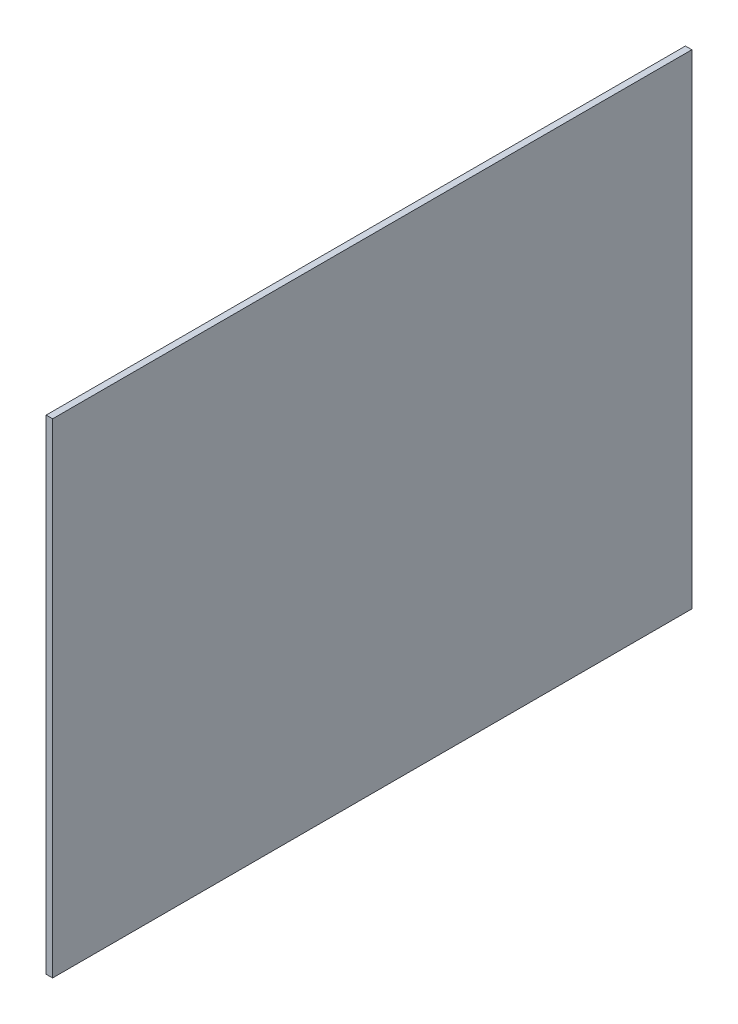
ISO-10303-21;
HEADER;
FILE_DESCRIPTION(('STEP AP214'),'2;1');
FILE_NAME('part.step','',(''),(''),'','','');
FILE_SCHEMA(('AUTOMOTIVE_DESIGN { 1 0 10303 214 1 1 1 1 }'));
ENDSEC;
DATA;
#1=APPLICATION_CONTEXT('core data for automotive mechanical design processes');
#2=APPLICATION_PROTOCOL_DEFINITION('international standard','automotive_design',2000,#1);
#3=PRODUCT_CONTEXT('',#1,'mechanical');
#4=PRODUCT('Part','Part','',(#3));
#5=PRODUCT_RELATED_PRODUCT_CATEGORY('part','',(#4));
#6=PRODUCT_DEFINITION_FORMATION('','',#4);
#7=PRODUCT_DEFINITION_CONTEXT('part definition',#1,'design');
#8=PRODUCT_DEFINITION('design','',#6,#7);
#9=PRODUCT_DEFINITION_SHAPE('','',#8);
#10=(LENGTH_UNIT() NAMED_UNIT(*) SI_UNIT(.MILLI.,.METRE.));
#11=(NAMED_UNIT(*) PLANE_ANGLE_UNIT() SI_UNIT($,.RADIAN.));
#12=(NAMED_UNIT(*) SI_UNIT($,.STERADIAN.) SOLID_ANGLE_UNIT());
#13=UNCERTAINTY_MEASURE_WITH_UNIT(LENGTH_MEASURE(1.E-05),#10,'distance_accuracy_value','');
#14=(GEOMETRIC_REPRESENTATION_CONTEXT(3) GLOBAL_UNCERTAINTY_ASSIGNED_CONTEXT((#13)) GLOBAL_UNIT_ASSIGNED_CONTEXT((#10,
#11,#12)) REPRESENTATION_CONTEXT('',''));
#15=CARTESIAN_POINT('',(0.,0.,0.));
#16=DIRECTION('',(0.,0.,1.));
#17=DIRECTION('',(1.,0.,0.));
#18=AXIS2_PLACEMENT_3D('',#15,#16,#17);
#19=CARTESIAN_POINT('',(-2.,-75.,99.));
#20=DIRECTION('',(0.,0.,1.));
#21=DIRECTION('',(1.,0.,0.));
#22=AXIS2_PLACEMENT_3D('',#19,#20,#21);
#23=PLANE('',#22);
#24=DIRECTION('',(0.,-1.,0.));
#25=VECTOR('',#24,1.);
#26=CARTESIAN_POINT('',(0.,-75.,99.));
#27=LINE('',#26,#25);
#28=CARTESIAN_POINT('',(0.,75.,99.));
#29=VERTEX_POINT('',#28);
#30=CARTESIAN_POINT('',(0.,-75.,99.));
#31=VERTEX_POINT('',#30);
#32=EDGE_CURVE('E105',#29,#31,#27,.T.);
#33=ORIENTED_EDGE('',*,*,#32,.F.);
#34=DIRECTION('',(1.,0.,0.));
#35=VECTOR('',#34,1.);
#36=CARTESIAN_POINT('',(-2.,75.,99.));
#37=LINE('',#36,#35);
#38=CARTESIAN_POINT('',(-2.,75.,99.));
#39=VERTEX_POINT('',#38);
#40=EDGE_CURVE('E11',#39,#29,#37,.T.);
#41=ORIENTED_EDGE('',*,*,#40,.F.);
#42=DIRECTION('',(0.,-1.,0.));
#43=VECTOR('',#42,1.);
#44=CARTESIAN_POINT('',(-2.,-75.,99.));
#45=LINE('',#44,#43);
#46=CARTESIAN_POINT('',(-2.,-75.,99.));
#47=VERTEX_POINT('',#46);
#48=EDGE_CURVE('E99',#39,#47,#45,.T.);
#49=ORIENTED_EDGE('',*,*,#48,.T.);
#50=DIRECTION('',(1.,0.,0.));
#51=VECTOR('',#50,1.);
#52=CARTESIAN_POINT('',(-2.,-75.,99.));
#53=LINE('',#52,#51);
#54=EDGE_CURVE('E44',#47,#31,#53,.T.);
#55=ORIENTED_EDGE('',*,*,#54,.T.);
#56=EDGE_LOOP('',(#33,#41,#49,#55));
#57=FACE_BOUND('',#56,.T.);
#58=ADVANCED_FACE('F41',(#57),#23,.T.);
#59=CARTESIAN_POINT('',(-2.,75.,-99.));
#60=DIRECTION('',(0.,1.,0.));
#61=DIRECTION('',(0.,0.,1.));
#62=AXIS2_PLACEMENT_3D('',#59,#60,#61);
#63=PLANE('',#62);
#64=DIRECTION('',(0.,0.,1.));
#65=VECTOR('',#64,1.);
#66=CARTESIAN_POINT('',(0.,75.,-99.));
#67=LINE('',#66,#65);
#68=CARTESIAN_POINT('',(0.,75.,-99.));
#69=VERTEX_POINT('',#68);
#70=EDGE_CURVE('E101',#69,#29,#67,.T.);
#71=ORIENTED_EDGE('',*,*,#70,.F.);
#72=DIRECTION('',(1.,0.,0.));
#73=VECTOR('',#72,1.);
#74=CARTESIAN_POINT('',(-2.,75.,-99.));
#75=LINE('',#74,#73);
#76=CARTESIAN_POINT('',(-2.,75.,-99.));
#77=VERTEX_POINT('',#76);
#78=EDGE_CURVE('E50',#77,#69,#75,.T.);
#79=ORIENTED_EDGE('',*,*,#78,.F.);
#80=DIRECTION('',(0.,0.,1.));
#81=VECTOR('',#80,1.);
#82=CARTESIAN_POINT('',(-2.,75.,-99.));
#83=LINE('',#82,#81);
#84=EDGE_CURVE('E96',#77,#39,#83,.T.);
#85=ORIENTED_EDGE('',*,*,#84,.T.);
#86=ORIENTED_EDGE('',*,*,#40,.T.);
#87=EDGE_LOOP('',(#71,#79,#85,#86));
#88=FACE_BOUND('',#87,.T.);
#89=ADVANCED_FACE('F115',(#88),#63,.T.);
#90=CARTESIAN_POINT('',(-2.,-75.,-99.));
#91=DIRECTION('',(0.,0.,-1.));
#92=DIRECTION('',(-1.,0.,0.));
#93=AXIS2_PLACEMENT_3D('',#90,#91,#92);
#94=PLANE('',#93);
#95=DIRECTION('',(0.,1.,0.));
#96=VECTOR('',#95,1.);
#97=CARTESIAN_POINT('',(0.,-75.,-99.));
#98=LINE('',#97,#96);
#99=CARTESIAN_POINT('',(0.,-75.,-99.));
#100=VERTEX_POINT('',#99);
#101=EDGE_CURVE('E91',#100,#69,#98,.T.);
#102=ORIENTED_EDGE('',*,*,#101,.F.);
#103=DIRECTION('',(1.,0.,0.));
#104=VECTOR('',#103,1.);
#105=CARTESIAN_POINT('',(-2.,-75.,-99.));
#106=LINE('',#105,#104);
#107=CARTESIAN_POINT('',(-2.,-75.,-99.));
#108=VERTEX_POINT('',#107);
#109=EDGE_CURVE('E86',#108,#100,#106,.T.);
#110=ORIENTED_EDGE('',*,*,#109,.F.);
#111=DIRECTION('',(0.,1.,0.));
#112=VECTOR('',#111,1.);
#113=CARTESIAN_POINT('',(-2.,-75.,-99.));
#114=LINE('',#113,#112);
#115=EDGE_CURVE('E89',#108,#77,#114,.T.);
#116=ORIENTED_EDGE('',*,*,#115,.T.);
#117=ORIENTED_EDGE('',*,*,#78,.T.);
#118=EDGE_LOOP('',(#102,#110,#116,#117));
#119=FACE_BOUND('',#118,.T.);
#120=ADVANCED_FACE('F88',(#119),#94,.T.);
#121=CARTESIAN_POINT('',(-2.,-75.,-99.));
#122=DIRECTION('',(0.,-1.,0.));
#123=DIRECTION('',(0.,0.,-1.));
#124=AXIS2_PLACEMENT_3D('',#121,#122,#123);
#125=PLANE('',#124);
#126=DIRECTION('',(0.,0.,-1.));
#127=VECTOR('',#126,1.);
#128=CARTESIAN_POINT('',(0.,-75.,-99.));
#129=LINE('',#128,#127);
#130=EDGE_CURVE('E108',#31,#100,#129,.T.);
#131=ORIENTED_EDGE('',*,*,#130,.F.);
#132=ORIENTED_EDGE('',*,*,#54,.F.);
#133=DIRECTION('',(0.,0.,-1.));
#134=VECTOR('',#133,1.);
#135=CARTESIAN_POINT('',(-2.,-75.,-99.));
#136=LINE('',#135,#134);
#137=EDGE_CURVE('E95',#47,#108,#136,.T.);
#138=ORIENTED_EDGE('',*,*,#137,.T.);
#139=ORIENTED_EDGE('',*,*,#109,.T.);
#140=EDGE_LOOP('',(#131,#132,#138,#139));
#141=FACE_BOUND('',#140,.T.);
#142=ADVANCED_FACE('F98',(#141),#125,.T.);
#143=CARTESIAN_POINT('',(-2.,0.,0.));
#144=DIRECTION('',(1.,0.,0.));
#145=DIRECTION('',(0.,0.,-1.));
#146=AXIS2_PLACEMENT_3D('',#143,#144,#145);
#147=PLANE('',#146);
#148=ORIENTED_EDGE('',*,*,#48,.F.);
#149=ORIENTED_EDGE('',*,*,#84,.F.);
#150=ORIENTED_EDGE('',*,*,#115,.F.);
#151=ORIENTED_EDGE('',*,*,#137,.F.);
#152=EDGE_LOOP('',(#148,#149,#150,#151));
#153=FACE_BOUND('',#152,.T.);
#154=ADVANCED_FACE('F94',(#153),#147,.F.);
#155=CARTESIAN_POINT('',(0.,0.,0.));
#156=DIRECTION('',(1.,0.,0.));
#157=DIRECTION('',(0.,0.,-1.));
#158=AXIS2_PLACEMENT_3D('',#155,#156,#157);
#159=PLANE('',#158);
#160=ORIENTED_EDGE('',*,*,#32,.T.);
#161=ORIENTED_EDGE('',*,*,#130,.T.);
#162=ORIENTED_EDGE('',*,*,#101,.T.);
#163=ORIENTED_EDGE('',*,*,#70,.T.);
#164=EDGE_LOOP('',(#160,#161,#162,#163));
#165=FACE_BOUND('',#164,.T.);
#166=ADVANCED_FACE('F114',(#165),#159,.T.);
#167=CLOSED_SHELL('',(#58,#89,#120,#142,#154,#166));
#168=MANIFOLD_SOLID_BREP('B2',#167);
#169=ADVANCED_BREP_SHAPE_REPRESENTATION('',(#18,#168),#14);
#170=SHAPE_DEFINITION_REPRESENTATION(#9,#169);
ENDSEC;
END-ISO-10303-21;
